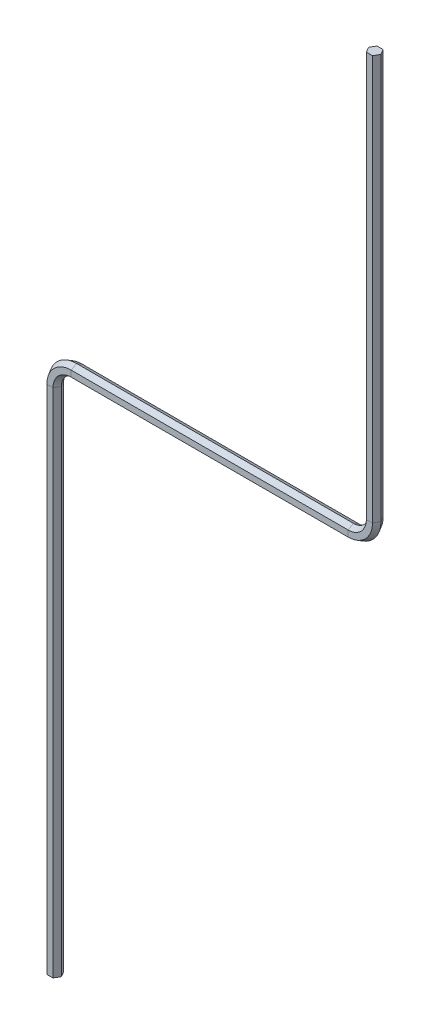
ISO-10303-21;
HEADER;
FILE_DESCRIPTION(('STEP AP214'),'2;1');
FILE_NAME('part.step','',(''),(''),'','','');
FILE_SCHEMA(('AUTOMOTIVE_DESIGN { 1 0 10303 214 1 1 1 1 }'));
ENDSEC;
DATA;
#1=APPLICATION_CONTEXT('core data for automotive mechanical design processes');
#2=APPLICATION_PROTOCOL_DEFINITION('international standard','automotive_design',2000,#1);
#3=PRODUCT_CONTEXT('',#1,'mechanical');
#4=PRODUCT('Part','Part','',(#3));
#5=PRODUCT_RELATED_PRODUCT_CATEGORY('part','',(#4));
#6=PRODUCT_DEFINITION_FORMATION('','',#4);
#7=PRODUCT_DEFINITION_CONTEXT('part definition',#1,'design');
#8=PRODUCT_DEFINITION('design','',#6,#7);
#9=PRODUCT_DEFINITION_SHAPE('','',#8);
#10=(LENGTH_UNIT() NAMED_UNIT(*) SI_UNIT(.MILLI.,.METRE.));
#11=(NAMED_UNIT(*) PLANE_ANGLE_UNIT() SI_UNIT($,.RADIAN.));
#12=(NAMED_UNIT(*) SI_UNIT($,.STERADIAN.) SOLID_ANGLE_UNIT());
#13=UNCERTAINTY_MEASURE_WITH_UNIT(LENGTH_MEASURE(1.E-05),#10,'distance_accuracy_value','');
#14=(GEOMETRIC_REPRESENTATION_CONTEXT(3) GLOBAL_UNCERTAINTY_ASSIGNED_CONTEXT((#13)) GLOBAL_UNIT_ASSIGNED_CONTEXT((#10,
#11,#12)) REPRESENTATION_CONTEXT('',''));
#15=CARTESIAN_POINT('',(0.,0.,0.));
#16=DIRECTION('',(0.,0.,1.));
#17=DIRECTION('',(1.,0.,0.));
#18=AXIS2_PLACEMENT_3D('',#15,#16,#17);
#19=CARTESIAN_POINT('',(0.,0.,0.));
#20=DIRECTION('',(0.,1.,0.));
#21=DIRECTION('',(0.,0.,1.));
#22=AXIS2_PLACEMENT_3D('',#19,#20,#21);
#23=PLANE('',#22);
#24=DIRECTION('',(-0.5,0.,-0.866025403784439));
#25=VECTOR('',#24,1.);
#26=CARTESIAN_POINT('',(5.77350269189627,0.,0.));
#27=LINE('',#26,#25);
#28=CARTESIAN_POINT('',(5.77350269189627,0.,0.));
#29=VERTEX_POINT('',#28);
#30=CARTESIAN_POINT('',(2.88675134594814,0.,-5.));
#31=VERTEX_POINT('',#30);
#32=EDGE_CURVE('E216',#29,#31,#27,.T.);
#33=ORIENTED_EDGE('',*,*,#32,.F.);
#34=DIRECTION('',(0.500000000000001,0.,-0.866025403784438));
#35=VECTOR('',#34,1.);
#36=CARTESIAN_POINT('',(2.88675134594813,0.,5.00000000000002));
#37=LINE('',#36,#35);
#38=CARTESIAN_POINT('',(2.88675134594813,0.,5.00000000000002));
#39=VERTEX_POINT('',#38);
#40=EDGE_CURVE('E218',#39,#29,#37,.T.);
#41=ORIENTED_EDGE('',*,*,#40,.F.);
#42=DIRECTION('',(1.,0.,0.));
#43=VECTOR('',#42,1.);
#44=CARTESIAN_POINT('',(-2.88675134594811,0.,5.00000000000002));
#45=LINE('',#44,#43);
#46=CARTESIAN_POINT('',(-2.88675134594811,0.,5.00000000000002));
#47=VERTEX_POINT('',#46);
#48=EDGE_CURVE('E237',#47,#39,#45,.T.);
#49=ORIENTED_EDGE('',*,*,#48,.F.);
#50=DIRECTION('',(0.5,0.,0.866025403784439));
#51=VECTOR('',#50,1.);
#52=CARTESIAN_POINT('',(-5.77350269189625,0.,0.));
#53=LINE('',#52,#51);
#54=CARTESIAN_POINT('',(-5.77350269189625,0.,0.));
#55=VERTEX_POINT('',#54);
#56=EDGE_CURVE('E339',#55,#47,#53,.T.);
#57=ORIENTED_EDGE('',*,*,#56,.F.);
#58=DIRECTION('',(-0.499999999999999,0.,0.866025403784439));
#59=VECTOR('',#58,1.);
#60=CARTESIAN_POINT('',(-2.88675134594812,0.,-5.));
#61=LINE('',#60,#59);
#62=CARTESIAN_POINT('',(-2.88675134594812,0.,-5.));
#63=VERTEX_POINT('',#62);
#64=EDGE_CURVE('E303',#63,#55,#61,.T.);
#65=ORIENTED_EDGE('',*,*,#64,.F.);
#66=DIRECTION('',(-1.,0.,0.));
#67=VECTOR('',#66,1.);
#68=CARTESIAN_POINT('',(2.88675134594814,0.,-5.));
#69=LINE('',#68,#67);
#70=EDGE_CURVE('E221',#31,#63,#69,.T.);
#71=ORIENTED_EDGE('',*,*,#70,.F.);
#72=EDGE_LOOP('',(#33,#41,#49,#57,#65,#71));
#73=FACE_BOUND('',#72,.T.);
#74=ADVANCED_FACE('F39',(#73),#23,.F.);
#75=CARTESIAN_POINT('',(300.,900.,0.));
#76=DIRECTION('',(0.,1.,0.));
#77=DIRECTION('',(0.,0.,1.));
#78=AXIS2_PLACEMENT_3D('',#75,#76,#77);
#79=PLANE('',#78);
#80=DIRECTION('',(-0.5,0.,-0.866025403784439));
#81=VECTOR('',#80,1.);
#82=CARTESIAN_POINT('',(305.773502691896,900.,0.));
#83=LINE('',#82,#81);
#84=CARTESIAN_POINT('',(305.773502691896,900.,0.));
#85=VERTEX_POINT('',#84);
#86=CARTESIAN_POINT('',(302.886751345948,900.,-5.));
#87=VERTEX_POINT('',#86);
#88=EDGE_CURVE('E288',#85,#87,#83,.T.);
#89=ORIENTED_EDGE('',*,*,#88,.T.);
#90=DIRECTION('',(-1.,0.,0.));
#91=VECTOR('',#90,1.);
#92=CARTESIAN_POINT('',(302.886751345948,900.,-5.));
#93=LINE('',#92,#91);
#94=CARTESIAN_POINT('',(297.113248654052,900.,-5.));
#95=VERTEX_POINT('',#94);
#96=EDGE_CURVE('E296',#87,#95,#93,.T.);
#97=ORIENTED_EDGE('',*,*,#96,.T.);
#98=DIRECTION('',(-0.499999999999999,0.,0.866025403784439));
#99=VECTOR('',#98,1.);
#100=CARTESIAN_POINT('',(297.113248654052,900.,-5.));
#101=LINE('',#100,#99);
#102=CARTESIAN_POINT('',(294.226497308104,900.,0.));
#103=VERTEX_POINT('',#102);
#104=EDGE_CURVE('E335',#95,#103,#101,.T.);
#105=ORIENTED_EDGE('',*,*,#104,.T.);
#106=DIRECTION('',(0.5,0.,0.866025403784439));
#107=VECTOR('',#106,1.);
#108=CARTESIAN_POINT('',(294.226497308104,900.,0.));
#109=LINE('',#108,#107);
#110=CARTESIAN_POINT('',(297.113248654052,900.,5.00000000000002));
#111=VERTEX_POINT('',#110);
#112=EDGE_CURVE('E59',#103,#111,#109,.T.);
#113=ORIENTED_EDGE('',*,*,#112,.T.);
#114=DIRECTION('',(1.,0.,0.));
#115=VECTOR('',#114,1.);
#116=CARTESIAN_POINT('',(297.113248654052,900.,5.00000000000002));
#117=LINE('',#116,#115);
#118=CARTESIAN_POINT('',(302.886751345948,900.,5.00000000000002));
#119=VERTEX_POINT('',#118);
#120=EDGE_CURVE('E53',#111,#119,#117,.T.);
#121=ORIENTED_EDGE('',*,*,#120,.T.);
#122=DIRECTION('',(0.500000000000001,0.,-0.866025403784438));
#123=VECTOR('',#122,1.);
#124=CARTESIAN_POINT('',(302.886751345948,900.,5.00000000000002));
#125=LINE('',#124,#123);
#126=EDGE_CURVE('E11',#119,#85,#125,.T.);
#127=ORIENTED_EDGE('',*,*,#126,.T.);
#128=EDGE_LOOP('',(#89,#97,#105,#113,#121,#127));
#129=FACE_BOUND('',#128,.T.);
#130=ADVANCED_FACE('F487',(#129),#79,.T.);
#131=CARTESIAN_POINT('',(5.77350269189627,0.,0.));
#132=DIRECTION('',(0.866025403784439,0.,-0.5));
#133=DIRECTION('',(-0.5,0.,-0.866025403784439));
#134=AXIS2_PLACEMENT_3D('',#131,#132,#133);
#135=PLANE('',#134);
#136=DIRECTION('',(0.,1.,0.));
#137=VECTOR('',#136,1.);
#138=CARTESIAN_POINT('',(2.88675134594814,0.,-5.));
#139=LINE('',#138,#137);
#140=CARTESIAN_POINT('',(2.88675134594814,480.,-5.));
#141=VERTEX_POINT('',#140);
#142=EDGE_CURVE('E246',#31,#141,#139,.T.);
#143=ORIENTED_EDGE('',*,*,#142,.T.);
#144=DIRECTION('',(-0.5,0.,-0.866025403784439));
#145=VECTOR('',#144,1.);
#146=CARTESIAN_POINT('',(5.77350269189627,480.,0.));
#147=LINE('',#146,#145);
#148=CARTESIAN_POINT('',(5.77350269189627,480.,0.));
#149=VERTEX_POINT('',#148);
#150=EDGE_CURVE('E242',#149,#141,#147,.T.);
#151=ORIENTED_EDGE('',*,*,#150,.F.);
#152=DIRECTION('',(0.,1.,0.));
#153=VECTOR('',#152,1.);
#154=CARTESIAN_POINT('',(5.77350269189627,0.,0.));
#155=LINE('',#154,#153);
#156=EDGE_CURVE('E233',#29,#149,#155,.T.);
#157=ORIENTED_EDGE('',*,*,#156,.F.);
#158=ORIENTED_EDGE('',*,*,#32,.T.);
#159=EDGE_LOOP('',(#143,#151,#157,#158));
#160=FACE_BOUND('',#159,.T.);
#161=ADVANCED_FACE('F240',(#160),#135,.T.);
#162=CARTESIAN_POINT('',(2.88675134594814,0.,-5.));
#163=DIRECTION('',(0.,0.,-1.));
#164=DIRECTION('',(-1.,0.,0.));
#165=AXIS2_PLACEMENT_3D('',#162,#163,#164);
#166=PLANE('',#165);
#167=DIRECTION('',(0.,1.,0.));
#168=VECTOR('',#167,1.);
#169=CARTESIAN_POINT('',(-2.88675134594812,0.,-5.));
#170=LINE('',#169,#168);
#171=CARTESIAN_POINT('',(-2.88675134594812,480.,-5.));
#172=VERTEX_POINT('',#171);
#173=EDGE_CURVE('E307',#63,#172,#170,.T.);
#174=ORIENTED_EDGE('',*,*,#173,.T.);
#175=DIRECTION('',(-1.,0.,0.));
#176=VECTOR('',#175,1.);
#177=CARTESIAN_POINT('',(2.88675134594814,480.,-5.));
#178=LINE('',#177,#176);
#179=EDGE_CURVE('E304',#141,#172,#178,.T.);
#180=ORIENTED_EDGE('',*,*,#179,.F.);
#181=ORIENTED_EDGE('',*,*,#142,.F.);
#182=ORIENTED_EDGE('',*,*,#70,.T.);
#183=EDGE_LOOP('',(#174,#180,#181,#182));
#184=FACE_BOUND('',#183,.T.);
#185=ADVANCED_FACE('F514',(#184),#166,.T.);
#186=CARTESIAN_POINT('',(-2.88675134594812,0.,-5.));
#187=DIRECTION('',(-0.866025403784439,0.,-0.499999999999999));
#188=DIRECTION('',(-0.5,0.,0.866025403784439));
#189=AXIS2_PLACEMENT_3D('',#186,#187,#188);
#190=PLANE('',#189);
#191=DIRECTION('',(0.,1.,0.));
#192=VECTOR('',#191,1.);
#193=CARTESIAN_POINT('',(-5.77350269189625,0.,0.));
#194=LINE('',#193,#192);
#195=CARTESIAN_POINT('',(-5.77350269189625,480.,0.));
#196=VERTEX_POINT('',#195);
#197=EDGE_CURVE('E342',#55,#196,#194,.T.);
#198=ORIENTED_EDGE('',*,*,#197,.T.);
#199=DIRECTION('',(-0.499999999999999,0.,0.866025403784439));
#200=VECTOR('',#199,1.);
#201=CARTESIAN_POINT('',(-2.88675134594812,480.,-5.));
#202=LINE('',#201,#200);
#203=EDGE_CURVE('E311',#172,#196,#202,.T.);
#204=ORIENTED_EDGE('',*,*,#203,.F.);
#205=ORIENTED_EDGE('',*,*,#173,.F.);
#206=ORIENTED_EDGE('',*,*,#64,.T.);
#207=EDGE_LOOP('',(#198,#204,#205,#206));
#208=FACE_BOUND('',#207,.T.);
#209=ADVANCED_FACE('F537',(#208),#190,.T.);
#210=CARTESIAN_POINT('',(-5.77350269189625,0.,0.));
#211=DIRECTION('',(-0.866025403784439,0.,0.5));
#212=DIRECTION('',(0.5,0.,0.866025403784439));
#213=AXIS2_PLACEMENT_3D('',#210,#211,#212);
#214=PLANE('',#213);
#215=DIRECTION('',(0.,1.,0.));
#216=VECTOR('',#215,1.);
#217=CARTESIAN_POINT('',(-2.88675134594811,0.,5.00000000000002));
#218=LINE('',#217,#216);
#219=CARTESIAN_POINT('',(-2.88675134594811,480.,5.00000000000002));
#220=VERTEX_POINT('',#219);
#221=EDGE_CURVE('E375',#47,#220,#218,.T.);
#222=ORIENTED_EDGE('',*,*,#221,.T.);
#223=DIRECTION('',(0.5,0.,0.866025403784439));
#224=VECTOR('',#223,1.);
#225=CARTESIAN_POINT('',(-5.77350269189625,480.,0.));
#226=LINE('',#225,#224);
#227=EDGE_CURVE('E346',#196,#220,#226,.T.);
#228=ORIENTED_EDGE('',*,*,#227,.F.);
#229=ORIENTED_EDGE('',*,*,#197,.F.);
#230=ORIENTED_EDGE('',*,*,#56,.T.);
#231=EDGE_LOOP('',(#222,#228,#229,#230));
#232=FACE_BOUND('',#231,.T.);
#233=ADVANCED_FACE('F547',(#232),#214,.T.);
#234=CARTESIAN_POINT('',(-2.88675134594811,0.,5.00000000000002));
#235=DIRECTION('',(0.,0.,1.));
#236=DIRECTION('',(1.,0.,0.));
#237=AXIS2_PLACEMENT_3D('',#234,#235,#236);
#238=PLANE('',#237);
#239=DIRECTION('',(0.,1.,0.));
#240=VECTOR('',#239,1.);
#241=CARTESIAN_POINT('',(2.88675134594813,0.,5.00000000000002));
#242=LINE('',#241,#240);
#243=CARTESIAN_POINT('',(2.88675134594813,480.,5.00000000000002));
#244=VERTEX_POINT('',#243);
#245=EDGE_CURVE('E235',#39,#244,#242,.T.);
#246=ORIENTED_EDGE('',*,*,#245,.T.);
#247=DIRECTION('',(1.,0.,0.));
#248=VECTOR('',#247,1.);
#249=CARTESIAN_POINT('',(-2.88675134594811,480.,5.00000000000002));
#250=LINE('',#249,#248);
#251=EDGE_CURVE('E379',#220,#244,#250,.T.);
#252=ORIENTED_EDGE('',*,*,#251,.F.);
#253=ORIENTED_EDGE('',*,*,#221,.F.);
#254=ORIENTED_EDGE('',*,*,#48,.T.);
#255=EDGE_LOOP('',(#246,#252,#253,#254));
#256=FACE_BOUND('',#255,.T.);
#257=ADVANCED_FACE('F463',(#256),#238,.T.);
#258=CARTESIAN_POINT('',(2.88675134594813,0.,5.00000000000002));
#259=DIRECTION('',(0.866025403784438,0.,0.500000000000001));
#260=DIRECTION('',(0.500000000000001,0.,-0.866025403784438));
#261=AXIS2_PLACEMENT_3D('',#258,#259,#260);
#262=PLANE('',#261);
#263=DIRECTION('',(0.500000000000001,0.,-0.866025403784438));
#264=VECTOR('',#263,1.);
#265=CARTESIAN_POINT('',(2.88675134594813,480.,5.00000000000002));
#266=LINE('',#265,#264);
#267=EDGE_CURVE('E261',#244,#149,#266,.T.);
#268=ORIENTED_EDGE('',*,*,#267,.F.);
#269=ORIENTED_EDGE('',*,*,#245,.F.);
#270=ORIENTED_EDGE('',*,*,#40,.T.);
#271=ORIENTED_EDGE('',*,*,#156,.T.);
#272=EDGE_LOOP('',(#268,#269,#270,#271));
#273=FACE_BOUND('',#272,.T.);
#274=ADVANCED_FACE('F232',(#273),#262,.T.);
#275=CARTESIAN_POINT('',(20.,480.,0.));
#276=DIRECTION('',(0.,0.,-1.));
#277=DIRECTION('',(-1.,0.,0.));
#278=AXIS2_PLACEMENT_3D('',#275,#276,#277);
#279=CONICAL_SURFACE('',#278,14.2264973081037,0.523598775598299);
#280=CARTESIAN_POINT('',(20.,480.,-5.));
#281=DIRECTION('',(0.,0.,-1.));
#282=DIRECTION('',(-1.,0.,0.));
#283=AXIS2_PLACEMENT_3D('',#280,#281,#282);
#284=CIRCLE('',#283,17.1132486540519);
#285=CARTESIAN_POINT('',(20.0000000000001,497.113248654052,-5.));
#286=VERTEX_POINT('',#285);
#287=EDGE_CURVE('E205',#141,#286,#284,.T.);
#288=ORIENTED_EDGE('',*,*,#287,.T.);
#289=DIRECTION('',(0.,0.5,-0.866025403784439));
#290=VECTOR('',#289,1.);
#291=CARTESIAN_POINT('',(20.0000000000001,494.226497308104,0.));
#292=LINE('',#291,#290);
#293=CARTESIAN_POINT('',(20.0000000000001,494.226497308104,0.));
#294=VERTEX_POINT('',#293);
#295=EDGE_CURVE('E250',#294,#286,#292,.T.);
#296=ORIENTED_EDGE('',*,*,#295,.F.);
#297=CARTESIAN_POINT('',(20.,480.,0.));
#298=DIRECTION('',(0.,0.,-1.));
#299=DIRECTION('',(-1.,0.,0.));
#300=AXIS2_PLACEMENT_3D('',#297,#298,#299);
#301=CIRCLE('',#300,14.2264973081037);
#302=EDGE_CURVE('E254',#149,#294,#301,.T.);
#303=ORIENTED_EDGE('',*,*,#302,.F.);
#304=ORIENTED_EDGE('',*,*,#150,.T.);
#305=EDGE_LOOP('',(#288,#296,#303,#304));
#306=FACE_BOUND('',#305,.T.);
#307=ADVANCED_FACE('F459',(#306),#279,.F.);
#308=CARTESIAN_POINT('',(2.88675134594813,480.,-5.));
#309=DIRECTION('',(0.,0.,-1.));
#310=DIRECTION('',(-1.,0.,0.));
#311=AXIS2_PLACEMENT_3D('',#308,#309,#310);
#312=PLANE('',#311);
#313=CARTESIAN_POINT('',(20.,480.,-5.));
#314=DIRECTION('',(0.,0.,-1.));
#315=DIRECTION('',(-1.,0.,0.));
#316=AXIS2_PLACEMENT_3D('',#313,#314,#315);
#317=CIRCLE('',#316,22.8867513459481);
#318=CARTESIAN_POINT('',(20.0000000000002,502.886751345948,-5.));
#319=VERTEX_POINT('',#318);
#320=EDGE_CURVE('E199',#172,#319,#317,.T.);
#321=ORIENTED_EDGE('',*,*,#320,.T.);
#322=DIRECTION('',(0.,1.,0.));
#323=VECTOR('',#322,1.);
#324=CARTESIAN_POINT('',(20.0000000000001,497.113248654052,-5.));
#325=LINE('',#324,#323);
#326=EDGE_CURVE('E257',#286,#319,#325,.T.);
#327=ORIENTED_EDGE('',*,*,#326,.F.);
#328=ORIENTED_EDGE('',*,*,#287,.F.);
#329=ORIENTED_EDGE('',*,*,#179,.T.);
#330=EDGE_LOOP('',(#321,#327,#328,#329));
#331=FACE_BOUND('',#330,.T.);
#332=ADVANCED_FACE('F582',(#331),#312,.T.);
#333=CARTESIAN_POINT('',(20.,480.,-5.));
#334=DIRECTION('',(0.,0.,1.));
#335=DIRECTION('',(1.,0.,0.));
#336=AXIS2_PLACEMENT_3D('',#333,#334,#335);
#337=CONICAL_SURFACE('',#336,22.8867513459481,0.523598775598298);
#338=CARTESIAN_POINT('',(20.,480.,0.));
#339=DIRECTION('',(0.,0.,-1.));
#340=DIRECTION('',(-1.,0.,0.));
#341=AXIS2_PLACEMENT_3D('',#338,#339,#340);
#342=CIRCLE('',#341,25.7735026918963);
#343=CARTESIAN_POINT('',(20.0000000000002,505.773502691896,0.));
#344=VERTEX_POINT('',#343);
#345=EDGE_CURVE('E349',#196,#344,#342,.T.);
#346=ORIENTED_EDGE('',*,*,#345,.T.);
#347=DIRECTION('',(0.,0.499999999999999,0.866025403784439));
#348=VECTOR('',#347,1.);
#349=CARTESIAN_POINT('',(20.0000000000002,502.886751345948,-5.));
#350=LINE('',#349,#348);
#351=EDGE_CURVE('E316',#319,#344,#350,.T.);
#352=ORIENTED_EDGE('',*,*,#351,.F.);
#353=ORIENTED_EDGE('',*,*,#320,.F.);
#354=ORIENTED_EDGE('',*,*,#203,.T.);
#355=EDGE_LOOP('',(#346,#352,#353,#354));
#356=FACE_BOUND('',#355,.T.);
#357=ADVANCED_FACE('F591',(#356),#337,.T.);
#358=CARTESIAN_POINT('',(20.,480.,0.));
#359=DIRECTION('',(0.,0.,-1.));
#360=DIRECTION('',(-1.,0.,0.));
#361=AXIS2_PLACEMENT_3D('',#358,#359,#360);
#362=CONICAL_SURFACE('',#361,25.7735026918963,0.523598775598299);
#363=CARTESIAN_POINT('',(20.,480.,5.00000000000002));
#364=DIRECTION('',(0.,0.,-1.));
#365=DIRECTION('',(-1.,0.,0.));
#366=AXIS2_PLACEMENT_3D('',#363,#364,#365);
#367=CIRCLE('',#366,22.8867513459481);
#368=CARTESIAN_POINT('',(20.0000000000002,502.886751345948,5.00000000000002));
#369=VERTEX_POINT('',#368);
#370=EDGE_CURVE('E382',#220,#369,#367,.T.);
#371=ORIENTED_EDGE('',*,*,#370,.T.);
#372=DIRECTION('',(0.,-0.5,0.866025403784439));
#373=VECTOR('',#372,1.);
#374=CARTESIAN_POINT('',(20.0000000000002,505.773502691896,0.));
#375=LINE('',#374,#373);
#376=EDGE_CURVE('E353',#344,#369,#375,.T.);
#377=ORIENTED_EDGE('',*,*,#376,.F.);
#378=ORIENTED_EDGE('',*,*,#345,.F.);
#379=ORIENTED_EDGE('',*,*,#227,.T.);
#380=EDGE_LOOP('',(#371,#377,#378,#379));
#381=FACE_BOUND('',#380,.T.);
#382=ADVANCED_FACE('F469',(#381),#362,.T.);
#383=CARTESIAN_POINT('',(-2.88675134594812,480.,5.00000000000002));
#384=DIRECTION('',(0.,0.,1.));
#385=DIRECTION('',(1.,0.,0.));
#386=AXIS2_PLACEMENT_3D('',#383,#384,#385);
#387=PLANE('',#386);
#388=CARTESIAN_POINT('',(20.,480.,5.00000000000002));
#389=DIRECTION('',(0.,0.,-1.));
#390=DIRECTION('',(-1.,0.,0.));
#391=AXIS2_PLACEMENT_3D('',#388,#389,#390);
#392=CIRCLE('',#391,17.1132486540519);
#393=CARTESIAN_POINT('',(20.0000000000001,497.113248654052,5.00000000000002));
#394=VERTEX_POINT('',#393);
#395=EDGE_CURVE('E413',#244,#394,#392,.T.);
#396=ORIENTED_EDGE('',*,*,#395,.T.);
#397=DIRECTION('',(0.,-1.,0.));
#398=VECTOR('',#397,1.);
#399=CARTESIAN_POINT('',(20.0000000000002,502.886751345948,5.00000000000002));
#400=LINE('',#399,#398);
#401=EDGE_CURVE('E386',#369,#394,#400,.T.);
#402=ORIENTED_EDGE('',*,*,#401,.F.);
#403=ORIENTED_EDGE('',*,*,#370,.F.);
#404=ORIENTED_EDGE('',*,*,#251,.T.);
#405=EDGE_LOOP('',(#396,#402,#403,#404));
#406=FACE_BOUND('',#405,.T.);
#407=ADVANCED_FACE('F466',(#406),#387,.T.);
#408=CARTESIAN_POINT('',(20.,480.,5.00000000000002));
#409=DIRECTION('',(0.,0.,1.));
#410=DIRECTION('',(1.,0.,0.));
#411=AXIS2_PLACEMENT_3D('',#408,#409,#410);
#412=CONICAL_SURFACE('',#411,17.1132486540519,0.5235987755983);
#413=DIRECTION('',(0.,-0.500000000000001,-0.866025403784438));
#414=VECTOR('',#413,1.);
#415=CARTESIAN_POINT('',(20.0000000000001,497.113248654052,5.00000000000002));
#416=LINE('',#415,#414);
#417=EDGE_CURVE('E273',#394,#294,#416,.T.);
#418=ORIENTED_EDGE('',*,*,#417,.F.);
#419=ORIENTED_EDGE('',*,*,#395,.F.);
#420=ORIENTED_EDGE('',*,*,#267,.T.);
#421=ORIENTED_EDGE('',*,*,#302,.T.);
#422=EDGE_LOOP('',(#418,#419,#420,#421));
#423=FACE_BOUND('',#422,.T.);
#424=ADVANCED_FACE('F460',(#423),#412,.F.);
#425=CARTESIAN_POINT('',(20.0000000000001,494.226497308104,0.));
#426=DIRECTION('',(0.,-0.866025403784439,-0.5));
#427=DIRECTION('',(0.,0.5,-0.866025403784439));
#428=AXIS2_PLACEMENT_3D('',#425,#426,#427);
#429=PLANE('',#428);
#430=DIRECTION('',(1.,0.,0.));
#431=VECTOR('',#430,1.);
#432=CARTESIAN_POINT('',(20.0000000000001,497.113248654052,-5.));
#433=LINE('',#432,#431);
#434=CARTESIAN_POINT('',(280.,497.113248654052,-5.));
#435=VERTEX_POINT('',#434);
#436=EDGE_CURVE('E178',#286,#435,#433,.T.);
#437=ORIENTED_EDGE('',*,*,#436,.T.);
#438=DIRECTION('',(0.,0.5,-0.866025403784439));
#439=VECTOR('',#438,1.);
#440=CARTESIAN_POINT('',(280.,494.226497308104,0.));
#441=LINE('',#440,#439);
#442=CARTESIAN_POINT('',(280.,494.226497308104,0.));
#443=VERTEX_POINT('',#442);
#444=EDGE_CURVE('E262',#443,#435,#441,.T.);
#445=ORIENTED_EDGE('',*,*,#444,.F.);
#446=DIRECTION('',(1.,0.,0.));
#447=VECTOR('',#446,1.);
#448=CARTESIAN_POINT('',(20.0000000000001,494.226497308104,0.));
#449=LINE('',#448,#447);
#450=EDGE_CURVE('E266',#294,#443,#449,.T.);
#451=ORIENTED_EDGE('',*,*,#450,.F.);
#452=ORIENTED_EDGE('',*,*,#295,.T.);
#453=EDGE_LOOP('',(#437,#445,#451,#452));
#454=FACE_BOUND('',#453,.T.);
#455=ADVANCED_FACE('F453',(#454),#429,.T.);
#456=CARTESIAN_POINT('',(20.0000000000001,497.113248654052,-5.));
#457=DIRECTION('',(0.,0.,-1.));
#458=DIRECTION('',(0.,1.,0.));
#459=AXIS2_PLACEMENT_3D('',#456,#457,#458);
#460=PLANE('',#459);
#461=DIRECTION('',(1.,0.,0.));
#462=VECTOR('',#461,1.);
#463=CARTESIAN_POINT('',(20.0000000000001,502.886751345948,-5.));
#464=LINE('',#463,#462);
#465=CARTESIAN_POINT('',(280.,502.886751345948,-5.));
#466=VERTEX_POINT('',#465);
#467=EDGE_CURVE('E170',#319,#466,#464,.T.);
#468=ORIENTED_EDGE('',*,*,#467,.T.);
#469=DIRECTION('',(0.,1.,0.));
#470=VECTOR('',#469,1.);
#471=CARTESIAN_POINT('',(280.,497.113248654052,-5.));
#472=LINE('',#471,#470);
#473=EDGE_CURVE('E269',#435,#466,#472,.T.);
#474=ORIENTED_EDGE('',*,*,#473,.F.);
#475=ORIENTED_EDGE('',*,*,#436,.F.);
#476=ORIENTED_EDGE('',*,*,#326,.T.);
#477=EDGE_LOOP('',(#468,#474,#475,#476));
#478=FACE_BOUND('',#477,.T.);
#479=ADVANCED_FACE('F631',(#478),#460,.T.);
#480=CARTESIAN_POINT('',(20.0000000000001,502.886751345948,-5.));
#481=DIRECTION('',(0.,0.866025403784439,-0.5));
#482=DIRECTION('',(0.,0.5,0.866025403784439));
#483=AXIS2_PLACEMENT_3D('',#480,#481,#482);
#484=PLANE('',#483);
#485=DIRECTION('',(1.,0.,0.));
#486=VECTOR('',#485,1.);
#487=CARTESIAN_POINT('',(20.0000000000001,505.773502691896,0.));
#488=LINE('',#487,#486);
#489=CARTESIAN_POINT('',(280.,505.773502691896,0.));
#490=VERTEX_POINT('',#489);
#491=EDGE_CURVE('E163',#344,#490,#488,.T.);
#492=ORIENTED_EDGE('',*,*,#491,.T.);
#493=DIRECTION('',(0.,0.499999999999999,0.866025403784439));
#494=VECTOR('',#493,1.);
#495=CARTESIAN_POINT('',(280.,502.886751345948,-5.));
#496=LINE('',#495,#494);
#497=EDGE_CURVE('E322',#466,#490,#496,.T.);
#498=ORIENTED_EDGE('',*,*,#497,.F.);
#499=ORIENTED_EDGE('',*,*,#467,.F.);
#500=ORIENTED_EDGE('',*,*,#351,.T.);
#501=EDGE_LOOP('',(#492,#498,#499,#500));
#502=FACE_BOUND('',#501,.T.);
#503=ADVANCED_FACE('F498',(#502),#484,.T.);
#504=CARTESIAN_POINT('',(20.0000000000001,505.773502691896,0.));
#505=DIRECTION('',(0.,0.866025403784439,0.5));
#506=DIRECTION('',(0.,-0.5,0.866025403784439));
#507=AXIS2_PLACEMENT_3D('',#504,#505,#506);
#508=PLANE('',#507);
#509=DIRECTION('',(1.,0.,0.));
#510=VECTOR('',#509,1.);
#511=CARTESIAN_POINT('',(20.0000000000001,502.886751345948,5.00000000000002));
#512=LINE('',#511,#510);
#513=CARTESIAN_POINT('',(280.,502.886751345948,5.00000000000002));
#514=VERTEX_POINT('',#513);
#515=EDGE_CURVE('E389',#369,#514,#512,.T.);
#516=ORIENTED_EDGE('',*,*,#515,.T.);
#517=DIRECTION('',(0.,-0.5,0.866025403784439));
#518=VECTOR('',#517,1.);
#519=CARTESIAN_POINT('',(280.,505.773502691896,0.));
#520=LINE('',#519,#518);
#521=EDGE_CURVE('E358',#490,#514,#520,.T.);
#522=ORIENTED_EDGE('',*,*,#521,.F.);
#523=ORIENTED_EDGE('',*,*,#491,.F.);
#524=ORIENTED_EDGE('',*,*,#376,.T.);
#525=EDGE_LOOP('',(#516,#522,#523,#524));
#526=FACE_BOUND('',#525,.T.);
#527=ADVANCED_FACE('F471',(#526),#508,.T.);
#528=CARTESIAN_POINT('',(20.0000000000001,502.886751345948,5.00000000000002));
#529=DIRECTION('',(0.,0.,1.));
#530=DIRECTION('',(1.,0.,0.));
#531=AXIS2_PLACEMENT_3D('',#528,#529,#530);
#532=PLANE('',#531);
#533=DIRECTION('',(1.,0.,0.));
#534=VECTOR('',#533,1.);
#535=CARTESIAN_POINT('',(20.0000000000001,497.113248654052,5.00000000000002));
#536=LINE('',#535,#534);
#537=CARTESIAN_POINT('',(280.,497.113248654052,5.00000000000002));
#538=VERTEX_POINT('',#537);
#539=EDGE_CURVE('E419',#394,#538,#536,.T.);
#540=ORIENTED_EDGE('',*,*,#539,.T.);
#541=DIRECTION('',(0.,-1.,0.));
#542=VECTOR('',#541,1.);
#543=CARTESIAN_POINT('',(280.,502.886751345948,5.00000000000002));
#544=LINE('',#543,#542);
#545=EDGE_CURVE('E393',#514,#538,#544,.T.);
#546=ORIENTED_EDGE('',*,*,#545,.F.);
#547=ORIENTED_EDGE('',*,*,#515,.F.);
#548=ORIENTED_EDGE('',*,*,#401,.T.);
#549=EDGE_LOOP('',(#540,#546,#547,#548));
#550=FACE_BOUND('',#549,.T.);
#551=ADVANCED_FACE('F490',(#550),#532,.T.);
#552=CARTESIAN_POINT('',(20.0000000000001,497.113248654052,5.00000000000002));
#553=DIRECTION('',(0.,-0.866025403784438,0.500000000000001));
#554=DIRECTION('',(0.,-0.500000000000001,-0.866025403784438));
#555=AXIS2_PLACEMENT_3D('',#552,#553,#554);
#556=PLANE('',#555);
#557=DIRECTION('',(0.,-0.500000000000001,-0.866025403784438));
#558=VECTOR('',#557,1.);
#559=CARTESIAN_POINT('',(280.,497.113248654052,5.00000000000002));
#560=LINE('',#559,#558);
#561=EDGE_CURVE('E287',#538,#443,#560,.T.);
#562=ORIENTED_EDGE('',*,*,#561,.F.);
#563=ORIENTED_EDGE('',*,*,#539,.F.);
#564=ORIENTED_EDGE('',*,*,#417,.T.);
#565=ORIENTED_EDGE('',*,*,#450,.T.);
#566=EDGE_LOOP('',(#562,#563,#564,#565));
#567=FACE_BOUND('',#566,.T.);
#568=ADVANCED_FACE('F454',(#567),#556,.T.);
#569=CARTESIAN_POINT('',(280.,520.,0.));
#570=DIRECTION('',(0.,0.,1.));
#571=DIRECTION('',(1.,0.,0.));
#572=AXIS2_PLACEMENT_3D('',#569,#570,#571);
#573=CONICAL_SURFACE('',#572,25.7735026918963,0.523598775598297);
#574=CARTESIAN_POINT('',(280.,520.,-5.));
#575=DIRECTION('',(0.,0.,1.));
#576=DIRECTION('',(0.,-1.,0.));
#577=AXIS2_PLACEMENT_3D('',#574,#575,#576);
#578=CIRCLE('',#577,22.8867513459481);
#579=CARTESIAN_POINT('',(302.886751345948,520.,-5.));
#580=VERTEX_POINT('',#579);
#581=EDGE_CURVE('E278',#435,#580,#578,.T.);
#582=ORIENTED_EDGE('',*,*,#581,.T.);
#583=DIRECTION('',(-0.5,0.,-0.866025403784439));
#584=VECTOR('',#583,1.);
#585=CARTESIAN_POINT('',(305.773502691896,520.,0.));
#586=LINE('',#585,#584);
#587=CARTESIAN_POINT('',(305.773502691896,520.,0.));
#588=VERTEX_POINT('',#587);
#589=EDGE_CURVE('E274',#588,#580,#586,.T.);
#590=ORIENTED_EDGE('',*,*,#589,.F.);
#591=CARTESIAN_POINT('',(280.,520.,0.));
#592=DIRECTION('',(0.,0.,1.));
#593=DIRECTION('',(0.,-1.,0.));
#594=AXIS2_PLACEMENT_3D('',#591,#592,#593);
#595=CIRCLE('',#594,25.7735026918963);
#596=EDGE_CURVE('E279',#443,#588,#595,.T.);
#597=ORIENTED_EDGE('',*,*,#596,.F.);
#598=ORIENTED_EDGE('',*,*,#444,.T.);
#599=EDGE_LOOP('',(#582,#590,#597,#598));
#600=FACE_BOUND('',#599,.T.);
#601=ADVANCED_FACE('F446',(#600),#573,.T.);
#602=CARTESIAN_POINT('',(280.,497.113248654052,-5.));
#603=DIRECTION('',(0.,0.,-1.));
#604=DIRECTION('',(-1.,0.,0.));
#605=AXIS2_PLACEMENT_3D('',#602,#603,#604);
#606=PLANE('',#605);
#607=CARTESIAN_POINT('',(280.,520.,-5.));
#608=DIRECTION('',(0.,0.,1.));
#609=DIRECTION('',(0.,-1.,0.));
#610=AXIS2_PLACEMENT_3D('',#607,#608,#609);
#611=CIRCLE('',#610,17.113248654052);
#612=CARTESIAN_POINT('',(297.113248654052,520.,-5.));
#613=VERTEX_POINT('',#612);
#614=EDGE_CURVE('E144',#466,#613,#611,.T.);
#615=ORIENTED_EDGE('',*,*,#614,.T.);
#616=DIRECTION('',(-1.,0.,0.));
#617=VECTOR('',#616,1.);
#618=CARTESIAN_POINT('',(302.886751345948,520.,-5.));
#619=LINE('',#618,#617);
#620=EDGE_CURVE('E283',#580,#613,#619,.T.);
#621=ORIENTED_EDGE('',*,*,#620,.F.);
#622=ORIENTED_EDGE('',*,*,#581,.F.);
#623=ORIENTED_EDGE('',*,*,#473,.T.);
#624=EDGE_LOOP('',(#615,#621,#622,#623));
#625=FACE_BOUND('',#624,.T.);
#626=ADVANCED_FACE('F481',(#625),#606,.T.);
#627=CARTESIAN_POINT('',(280.,520.,-5.));
#628=DIRECTION('',(0.,0.,-1.));
#629=DIRECTION('',(-1.,0.,0.));
#630=AXIS2_PLACEMENT_3D('',#627,#628,#629);
#631=CONICAL_SURFACE('',#630,17.113248654052,0.523598775598306);
#632=CARTESIAN_POINT('',(280.,520.,0.));
#633=DIRECTION('',(0.,0.,1.));
#634=DIRECTION('',(0.,-1.,0.));
#635=AXIS2_PLACEMENT_3D('',#632,#633,#634);
#636=CIRCLE('',#635,14.2264973081038);
#637=CARTESIAN_POINT('',(294.226497308104,520.,0.));
#638=VERTEX_POINT('',#637);
#639=EDGE_CURVE('E135',#490,#638,#636,.T.);
#640=ORIENTED_EDGE('',*,*,#639,.T.);
#641=DIRECTION('',(-0.499999999999999,0.,0.866025403784439));
#642=VECTOR('',#641,1.);
#643=CARTESIAN_POINT('',(297.113248654052,520.,-5.));
#644=LINE('',#643,#642);
#645=EDGE_CURVE('E328',#613,#638,#644,.T.);
#646=ORIENTED_EDGE('',*,*,#645,.F.);
#647=ORIENTED_EDGE('',*,*,#614,.F.);
#648=ORIENTED_EDGE('',*,*,#497,.T.);
#649=EDGE_LOOP('',(#640,#646,#647,#648));
#650=FACE_BOUND('',#649,.T.);
#651=ADVANCED_FACE('F478',(#650),#631,.F.);
#652=CARTESIAN_POINT('',(280.,520.,0.));
#653=DIRECTION('',(0.,0.,1.));
#654=DIRECTION('',(1.,0.,0.));
#655=AXIS2_PLACEMENT_3D('',#652,#653,#654);
#656=CONICAL_SURFACE('',#655,14.2264973081038,0.523598775598305);
#657=CARTESIAN_POINT('',(280.,520.,5.00000000000002));
#658=DIRECTION('',(0.,0.,1.));
#659=DIRECTION('',(0.,-1.,0.));
#660=AXIS2_PLACEMENT_3D('',#657,#658,#659);
#661=CIRCLE('',#660,17.113248654052);
#662=CARTESIAN_POINT('',(297.113248654052,520.,5.00000000000002));
#663=VERTEX_POINT('',#662);
#664=EDGE_CURVE('E128',#514,#663,#661,.T.);
#665=ORIENTED_EDGE('',*,*,#664,.T.);
#666=DIRECTION('',(0.5,0.,0.866025403784439));
#667=VECTOR('',#666,1.);
#668=CARTESIAN_POINT('',(294.226497308104,520.,0.));
#669=LINE('',#668,#667);
#670=EDGE_CURVE('E364',#638,#663,#669,.T.);
#671=ORIENTED_EDGE('',*,*,#670,.F.);
#672=ORIENTED_EDGE('',*,*,#639,.F.);
#673=ORIENTED_EDGE('',*,*,#521,.T.);
#674=EDGE_LOOP('',(#665,#671,#672,#673));
#675=FACE_BOUND('',#674,.T.);
#676=ADVANCED_FACE('F473',(#675),#656,.F.);
#677=CARTESIAN_POINT('',(280.,502.886751345948,5.00000000000002));
#678=DIRECTION('',(0.,0.,1.));
#679=DIRECTION('',(1.,0.,0.));
#680=AXIS2_PLACEMENT_3D('',#677,#678,#679);
#681=PLANE('',#680);
#682=CARTESIAN_POINT('',(280.,520.,5.00000000000002));
#683=DIRECTION('',(0.,0.,1.));
#684=DIRECTION('',(0.,-1.,0.));
#685=AXIS2_PLACEMENT_3D('',#682,#683,#684);
#686=CIRCLE('',#685,22.8867513459481);
#687=CARTESIAN_POINT('',(302.886751345948,520.,5.00000000000002));
#688=VERTEX_POINT('',#687);
#689=EDGE_CURVE('E425',#538,#688,#686,.T.);
#690=ORIENTED_EDGE('',*,*,#689,.T.);
#691=DIRECTION('',(1.,0.,0.));
#692=VECTOR('',#691,1.);
#693=CARTESIAN_POINT('',(297.113248654052,520.,5.00000000000002));
#694=LINE('',#693,#692);
#695=EDGE_CURVE('E398',#663,#688,#694,.T.);
#696=ORIENTED_EDGE('',*,*,#695,.F.);
#697=ORIENTED_EDGE('',*,*,#664,.F.);
#698=ORIENTED_EDGE('',*,*,#545,.T.);
#699=EDGE_LOOP('',(#690,#696,#697,#698));
#700=FACE_BOUND('',#699,.T.);
#701=ADVANCED_FACE('F489',(#700),#681,.T.);
#702=CARTESIAN_POINT('',(280.,520.,5.00000000000002));
#703=DIRECTION('',(0.,0.,-1.));
#704=DIRECTION('',(-1.,0.,0.));
#705=AXIS2_PLACEMENT_3D('',#702,#703,#704);
#706=CONICAL_SURFACE('',#705,22.8867513459481,0.523598775598297);
#707=DIRECTION('',(0.500000000000001,0.,-0.866025403784438));
#708=VECTOR('',#707,1.);
#709=CARTESIAN_POINT('',(302.886751345948,520.,5.00000000000002));
#710=LINE('',#709,#708);
#711=EDGE_CURVE('E300',#688,#588,#710,.T.);
#712=ORIENTED_EDGE('',*,*,#711,.F.);
#713=ORIENTED_EDGE('',*,*,#689,.F.);
#714=ORIENTED_EDGE('',*,*,#561,.T.);
#715=ORIENTED_EDGE('',*,*,#596,.T.);
#716=EDGE_LOOP('',(#712,#713,#714,#715));
#717=FACE_BOUND('',#716,.T.);
#718=ADVANCED_FACE('F448',(#717),#706,.T.);
#719=CARTESIAN_POINT('',(305.773502691896,520.,0.));
#720=DIRECTION('',(0.866025403784439,0.,-0.5));
#721=DIRECTION('',(-0.5,0.,-0.866025403784439));
#722=AXIS2_PLACEMENT_3D('',#719,#720,#721);
#723=PLANE('',#722);
#724=DIRECTION('',(0.,1.,0.));
#725=VECTOR('',#724,1.);
#726=CARTESIAN_POINT('',(302.886751345948,520.,-5.));
#727=LINE('',#726,#725);
#728=EDGE_CURVE('E291',#580,#87,#727,.T.);
#729=ORIENTED_EDGE('',*,*,#728,.T.);
#730=ORIENTED_EDGE('',*,*,#88,.F.);
#731=DIRECTION('',(0.,1.,0.));
#732=VECTOR('',#731,1.);
#733=CARTESIAN_POINT('',(305.773502691896,520.,0.));
#734=LINE('',#733,#732);
#735=EDGE_CURVE('E292',#588,#85,#734,.T.);
#736=ORIENTED_EDGE('',*,*,#735,.F.);
#737=ORIENTED_EDGE('',*,*,#589,.T.);
#738=EDGE_LOOP('',(#729,#730,#736,#737));
#739=FACE_BOUND('',#738,.T.);
#740=ADVANCED_FACE('F486',(#739),#723,.T.);
#741=CARTESIAN_POINT('',(302.886751345948,520.,-5.));
#742=DIRECTION('',(0.,0.,-1.));
#743=DIRECTION('',(-1.,0.,0.));
#744=AXIS2_PLACEMENT_3D('',#741,#742,#743);
#745=PLANE('',#744);
#746=DIRECTION('',(0.,1.,0.));
#747=VECTOR('',#746,1.);
#748=CARTESIAN_POINT('',(297.113248654052,520.,-5.));
#749=LINE('',#748,#747);
#750=EDGE_CURVE('E331',#613,#95,#749,.T.);
#751=ORIENTED_EDGE('',*,*,#750,.T.);
#752=ORIENTED_EDGE('',*,*,#96,.F.);
#753=ORIENTED_EDGE('',*,*,#728,.F.);
#754=ORIENTED_EDGE('',*,*,#620,.T.);
#755=EDGE_LOOP('',(#751,#752,#753,#754));
#756=FACE_BOUND('',#755,.T.);
#757=ADVANCED_FACE('F483',(#756),#745,.T.);
#758=CARTESIAN_POINT('',(297.113248654052,520.,-5.));
#759=DIRECTION('',(-0.866025403784439,0.,-0.499999999999999));
#760=DIRECTION('',(-0.5,0.,0.866025403784439));
#761=AXIS2_PLACEMENT_3D('',#758,#759,#760);
#762=PLANE('',#761);
#763=DIRECTION('',(0.,1.,0.));
#764=VECTOR('',#763,1.);
#765=CARTESIAN_POINT('',(294.226497308104,520.,0.));
#766=LINE('',#765,#764);
#767=EDGE_CURVE('E107',#638,#103,#766,.T.);
#768=ORIENTED_EDGE('',*,*,#767,.T.);
#769=ORIENTED_EDGE('',*,*,#104,.F.);
#770=ORIENTED_EDGE('',*,*,#750,.F.);
#771=ORIENTED_EDGE('',*,*,#645,.T.);
#772=EDGE_LOOP('',(#768,#769,#770,#771));
#773=FACE_BOUND('',#772,.T.);
#774=ADVANCED_FACE('F477',(#773),#762,.T.);
#775=CARTESIAN_POINT('',(294.226497308104,520.,0.));
#776=DIRECTION('',(-0.866025403784439,0.,0.5));
#777=DIRECTION('',(0.5,0.,0.866025403784439));
#778=AXIS2_PLACEMENT_3D('',#775,#776,#777);
#779=PLANE('',#778);
#780=DIRECTION('',(0.,1.,0.));
#781=VECTOR('',#780,1.);
#782=CARTESIAN_POINT('',(297.113248654052,520.,5.00000000000002));
#783=LINE('',#782,#781);
#784=EDGE_CURVE('E99',#663,#111,#783,.T.);
#785=ORIENTED_EDGE('',*,*,#784,.T.);
#786=ORIENTED_EDGE('',*,*,#112,.F.);
#787=ORIENTED_EDGE('',*,*,#767,.F.);
#788=ORIENTED_EDGE('',*,*,#670,.T.);
#789=EDGE_LOOP('',(#785,#786,#787,#788));
#790=FACE_BOUND('',#789,.T.);
#791=ADVANCED_FACE('F474',(#790),#779,.T.);
#792=CARTESIAN_POINT('',(297.113248654052,520.,5.00000000000002));
#793=DIRECTION('',(0.,0.,1.));
#794=DIRECTION('',(1.,0.,0.));
#795=AXIS2_PLACEMENT_3D('',#792,#793,#794);
#796=PLANE('',#795);
#797=DIRECTION('',(0.,1.,0.));
#798=VECTOR('',#797,1.);
#799=CARTESIAN_POINT('',(302.886751345948,520.,5.00000000000002));
#800=LINE('',#799,#798);
#801=EDGE_CURVE('E47',#688,#119,#800,.T.);
#802=ORIENTED_EDGE('',*,*,#801,.T.);
#803=ORIENTED_EDGE('',*,*,#120,.F.);
#804=ORIENTED_EDGE('',*,*,#784,.F.);
#805=ORIENTED_EDGE('',*,*,#695,.T.);
#806=EDGE_LOOP('',(#802,#803,#804,#805));
#807=FACE_BOUND('',#806,.T.);
#808=ADVANCED_FACE('F488',(#807),#796,.T.);
#809=CARTESIAN_POINT('',(302.886751345948,520.,5.00000000000002));
#810=DIRECTION('',(0.866025403784438,0.,0.500000000000001));
#811=DIRECTION('',(0.500000000000001,0.,-0.866025403784438));
#812=AXIS2_PLACEMENT_3D('',#809,#810,#811);
#813=PLANE('',#812);
#814=ORIENTED_EDGE('',*,*,#126,.F.);
#815=ORIENTED_EDGE('',*,*,#801,.F.);
#816=ORIENTED_EDGE('',*,*,#711,.T.);
#817=ORIENTED_EDGE('',*,*,#735,.T.);
#818=EDGE_LOOP('',(#814,#815,#816,#817));
#819=FACE_BOUND('',#818,.T.);
#820=ADVANCED_FACE('F443',(#819),#813,.T.);
#821=CLOSED_SHELL('',(#74,#130,#161,#185,#209,#233,#257,#274,#307,#332,#357,#382,#407,#424,#455,
#479,#503,#527,#551,#568,#601,#626,#651,#676,#701,#718,#740,#757,#774,#791,#808,#820));
#822=MANIFOLD_SOLID_BREP('B2',#821);
#823=ADVANCED_BREP_SHAPE_REPRESENTATION('',(#18,#822),#14);
#824=SHAPE_DEFINITION_REPRESENTATION(#9,#823);
ENDSEC;
END-ISO-10303-21;
